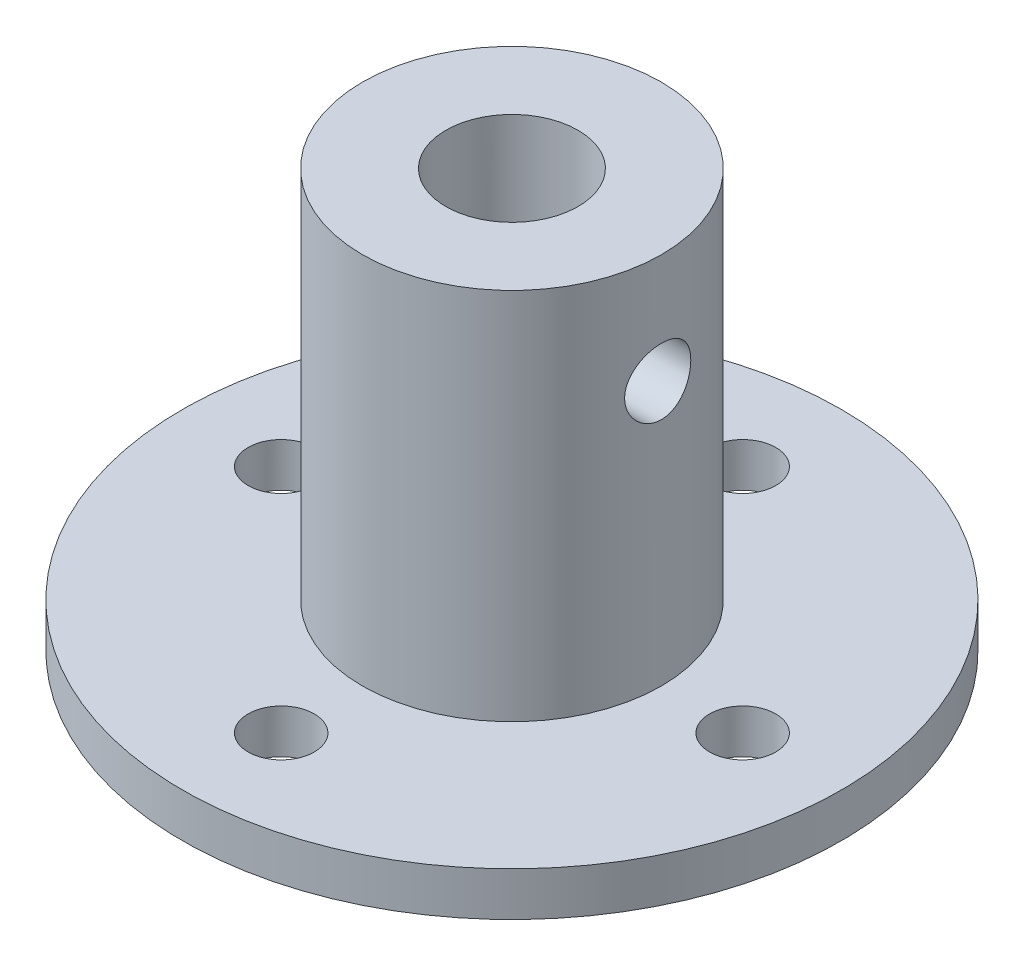
ISO-10303-21;
HEADER;
FILE_DESCRIPTION(('STEP AP214'),'2;1');
FILE_NAME('part.step','',(''),(''),'','','');
FILE_SCHEMA(('AUTOMOTIVE_DESIGN { 1 0 10303 214 1 1 1 1 }'));
ENDSEC;
DATA;
#1=APPLICATION_CONTEXT('core data for automotive mechanical design processes');
#2=APPLICATION_PROTOCOL_DEFINITION('international standard','automotive_design',2000,#1);
#3=PRODUCT_CONTEXT('',#1,'mechanical');
#4=PRODUCT('Part','Part','',(#3));
#5=PRODUCT_RELATED_PRODUCT_CATEGORY('part','',(#4));
#6=PRODUCT_DEFINITION_FORMATION('','',#4);
#7=PRODUCT_DEFINITION_CONTEXT('part definition',#1,'design');
#8=PRODUCT_DEFINITION('design','',#6,#7);
#9=PRODUCT_DEFINITION_SHAPE('','',#8);
#10=(LENGTH_UNIT() NAMED_UNIT(*) SI_UNIT(.MILLI.,.METRE.));
#11=(NAMED_UNIT(*) PLANE_ANGLE_UNIT() SI_UNIT($,.RADIAN.));
#12=(NAMED_UNIT(*) SI_UNIT($,.STERADIAN.) SOLID_ANGLE_UNIT());
#13=UNCERTAINTY_MEASURE_WITH_UNIT(LENGTH_MEASURE(1.E-05),#10,'distance_accuracy_value','');
#14=(GEOMETRIC_REPRESENTATION_CONTEXT(3) GLOBAL_UNCERTAINTY_ASSIGNED_CONTEXT((#13)) GLOBAL_UNIT_ASSIGNED_CONTEXT((#10,
#11,#12)) REPRESENTATION_CONTEXT('',''));
#15=CARTESIAN_POINT('',(0.,0.,0.));
#16=DIRECTION('',(0.,0.,1.));
#17=DIRECTION('',(1.,0.,0.));
#18=AXIS2_PLACEMENT_3D('',#15,#16,#17);
#19=CARTESIAN_POINT('',(0.,1.5875,-21.8080060784619));
#20=DIRECTION('',(0.,1.,0.));
#21=DIRECTION('',(0.,0.,1.));
#22=AXIS2_PLACEMENT_3D('',#19,#20,#21);
#23=PLANE('',#22);
#24=CARTESIAN_POINT('',(8.3312,1.5875,0.));
#25=DIRECTION('',(0.,1.,0.));
#26=DIRECTION('',(0.,0.,1.));
#27=AXIS2_PLACEMENT_3D('',#24,#25,#26);
#28=CIRCLE('',#27,1.1938);
#29=CARTESIAN_POINT('',(8.3312,1.5875,1.1938));
#30=VERTEX_POINT('',#29);
#31=EDGE_CURVE('E133',#30,#30,#28,.F.);
#32=ORIENTED_EDGE('',*,*,#31,.F.);
#33=EDGE_LOOP('',(#32));
#34=FACE_BOUND('',#33,.T.);
#35=CARTESIAN_POINT('',(-8.3312,1.5875,0.));
#36=DIRECTION('',(0.,1.,0.));
#37=DIRECTION('',(0.,0.,1.));
#38=AXIS2_PLACEMENT_3D('',#35,#36,#37);
#39=CIRCLE('',#38,1.1938);
#40=CARTESIAN_POINT('',(-8.3312,1.5875,1.1938));
#41=VERTEX_POINT('',#40);
#42=EDGE_CURVE('E57',#41,#41,#39,.F.);
#43=ORIENTED_EDGE('',*,*,#42,.F.);
#44=EDGE_LOOP('',(#43));
#45=FACE_BOUND('',#44,.T.);
#46=CARTESIAN_POINT('',(0.,1.5875,0.));
#47=DIRECTION('',(0.,-1.,0.));
#48=DIRECTION('',(0.,0.,-1.));
#49=AXIS2_PLACEMENT_3D('',#46,#47,#48);
#50=CIRCLE('',#49,3.9243);
#51=CARTESIAN_POINT('',(0.,1.5875,-3.9243));
#52=VERTEX_POINT('',#51);
#53=EDGE_CURVE('E39',#52,#52,#50,.T.);
#54=ORIENTED_EDGE('',*,*,#53,.F.);
#55=EDGE_LOOP('',(#54));
#56=FACE_BOUND('',#55,.T.);
#57=CARTESIAN_POINT('',(0.,1.5875,0.));
#58=DIRECTION('',(0.,-1.,0.));
#59=DIRECTION('',(0.,0.,-1.));
#60=AXIS2_PLACEMENT_3D('',#57,#58,#59);
#61=CIRCLE('',#60,11.8999);
#62=CARTESIAN_POINT('',(0.,1.5875,-11.8999));
#63=VERTEX_POINT('',#62);
#64=EDGE_CURVE('E44',#63,#63,#61,.T.);
#65=ORIENTED_EDGE('',*,*,#64,.T.);
#66=EDGE_LOOP('',(#65));
#67=FACE_BOUND('',#66,.T.);
#68=CARTESIAN_POINT('',(0.,1.5875,-8.3312));
#69=DIRECTION('',(0.,1.,0.));
#70=DIRECTION('',(0.,0.,1.));
#71=AXIS2_PLACEMENT_3D('',#68,#69,#70);
#72=CIRCLE('',#71,1.1938);
#73=CARTESIAN_POINT('',(0.,1.5875,-7.1374));
#74=VERTEX_POINT('',#73);
#75=EDGE_CURVE('E125',#74,#74,#72,.F.);
#76=ORIENTED_EDGE('',*,*,#75,.F.);
#77=EDGE_LOOP('',(#76));
#78=FACE_BOUND('',#77,.T.);
#79=CARTESIAN_POINT('',(0.,1.5875,8.3312));
#80=DIRECTION('',(0.,1.,0.));
#81=DIRECTION('',(0.,0.,1.));
#82=AXIS2_PLACEMENT_3D('',#79,#80,#81);
#83=CIRCLE('',#82,1.1938);
#84=CARTESIAN_POINT('',(0.,1.5875,9.525));
#85=VERTEX_POINT('',#84);
#86=EDGE_CURVE('E128',#85,#85,#83,.F.);
#87=ORIENTED_EDGE('',*,*,#86,.F.);
#88=EDGE_LOOP('',(#87));
#89=FACE_BOUND('',#88,.T.);
#90=ADVANCED_FACE('F31',(#34,#45,#56,#67,#78,#89),#23,.F.);
#91=CARTESIAN_POINT('',(0.,3.175,-21.8080060784619));
#92=DIRECTION('',(0.,-1.,0.));
#93=DIRECTION('',(0.,0.,-1.));
#94=AXIS2_PLACEMENT_3D('',#91,#92,#93);
#95=PLANE('',#94);
#96=CARTESIAN_POINT('',(8.3312,3.175,0.));
#97=DIRECTION('',(0.,-1.,0.));
#98=DIRECTION('',(0.,0.,-1.));
#99=AXIS2_PLACEMENT_3D('',#96,#97,#98);
#100=CIRCLE('',#99,1.1938);
#101=CARTESIAN_POINT('',(8.3312,3.175,-1.1938));
#102=VERTEX_POINT('',#101);
#103=EDGE_CURVE('E130',#102,#102,#100,.F.);
#104=ORIENTED_EDGE('',*,*,#103,.F.);
#105=EDGE_LOOP('',(#104));
#106=FACE_BOUND('',#105,.T.);
#107=CARTESIAN_POINT('',(-8.3312,3.175,0.));
#108=DIRECTION('',(0.,-1.,0.));
#109=DIRECTION('',(0.,0.,-1.));
#110=AXIS2_PLACEMENT_3D('',#107,#108,#109);
#111=CIRCLE('',#110,1.1938);
#112=CARTESIAN_POINT('',(-8.3312,3.175,-1.1938));
#113=VERTEX_POINT('',#112);
#114=EDGE_CURVE('E138',#113,#113,#111,.F.);
#115=ORIENTED_EDGE('',*,*,#114,.F.);
#116=EDGE_LOOP('',(#115));
#117=FACE_BOUND('',#116,.T.);
#118=CARTESIAN_POINT('',(0.,3.175,0.));
#119=DIRECTION('',(0.,-1.,0.));
#120=DIRECTION('',(0.,0.,-1.));
#121=AXIS2_PLACEMENT_3D('',#118,#119,#120);
#122=CIRCLE('',#121,11.8999);
#123=CARTESIAN_POINT('',(0.,3.175,-11.8999));
#124=VERTEX_POINT('',#123);
#125=EDGE_CURVE('E176',#124,#124,#122,.T.);
#126=ORIENTED_EDGE('',*,*,#125,.F.);
#127=EDGE_LOOP('',(#126));
#128=FACE_BOUND('',#127,.T.);
#129=CARTESIAN_POINT('',(0.,3.175,0.));
#130=DIRECTION('',(0.,-1.,0.));
#131=DIRECTION('',(0.,0.,-1.));
#132=AXIS2_PLACEMENT_3D('',#129,#130,#131);
#133=CIRCLE('',#132,5.3975);
#134=CARTESIAN_POINT('',(0.,3.175,-5.3975));
#135=VERTEX_POINT('',#134);
#136=EDGE_CURVE('E179',#135,#135,#133,.T.);
#137=ORIENTED_EDGE('',*,*,#136,.T.);
#138=EDGE_LOOP('',(#137));
#139=FACE_BOUND('',#138,.T.);
#140=CARTESIAN_POINT('',(0.,3.175,-8.3312));
#141=DIRECTION('',(0.,-1.,0.));
#142=DIRECTION('',(0.,0.,-1.));
#143=AXIS2_PLACEMENT_3D('',#140,#141,#142);
#144=CIRCLE('',#143,1.1938);
#145=CARTESIAN_POINT('',(0.,3.175,-9.525));
#146=VERTEX_POINT('',#145);
#147=EDGE_CURVE('E137',#146,#146,#144,.F.);
#148=ORIENTED_EDGE('',*,*,#147,.F.);
#149=EDGE_LOOP('',(#148));
#150=FACE_BOUND('',#149,.T.);
#151=CARTESIAN_POINT('',(0.,3.175,8.3312));
#152=DIRECTION('',(0.,-1.,0.));
#153=DIRECTION('',(0.,0.,-1.));
#154=AXIS2_PLACEMENT_3D('',#151,#152,#153);
#155=CIRCLE('',#154,1.1938);
#156=CARTESIAN_POINT('',(0.,3.175,7.1374));
#157=VERTEX_POINT('',#156);
#158=EDGE_CURVE('E35',#157,#157,#155,.F.);
#159=ORIENTED_EDGE('',*,*,#158,.F.);
#160=EDGE_LOOP('',(#159));
#161=FACE_BOUND('',#160,.T.);
#162=ADVANCED_FACE('F98',(#106,#117,#128,#139,#150,#161),#95,.F.);
#163=CARTESIAN_POINT('',(0.,0.,-21.8080060784619));
#164=DIRECTION('',(0.,1.,0.));
#165=DIRECTION('',(0.,0.,1.));
#166=AXIS2_PLACEMENT_3D('',#163,#164,#165);
#167=PLANE('',#166);
#168=CARTESIAN_POINT('',(0.,0.,0.));
#169=DIRECTION('',(0.,-1.,0.));
#170=DIRECTION('',(0.,0.,-1.));
#171=AXIS2_PLACEMENT_3D('',#168,#169,#170);
#172=CIRCLE('',#171,2.3876);
#173=CARTESIAN_POINT('',(0.,0.,-2.3876));
#174=VERTEX_POINT('',#173);
#175=EDGE_CURVE('E189',#174,#174,#172,.T.);
#176=ORIENTED_EDGE('',*,*,#175,.F.);
#177=EDGE_LOOP('',(#176));
#178=FACE_BOUND('',#177,.T.);
#179=CARTESIAN_POINT('',(0.,0.,0.));
#180=DIRECTION('',(0.,-1.,0.));
#181=DIRECTION('',(0.,0.,-1.));
#182=AXIS2_PLACEMENT_3D('',#179,#180,#181);
#183=CIRCLE('',#182,3.9243);
#184=CARTESIAN_POINT('',(0.,0.,-3.9243));
#185=VERTEX_POINT('',#184);
#186=EDGE_CURVE('E10',#185,#185,#183,.T.);
#187=ORIENTED_EDGE('',*,*,#186,.T.);
#188=EDGE_LOOP('',(#187));
#189=FACE_BOUND('',#188,.T.);
#190=ADVANCED_FACE('F33',(#178,#189),#167,.F.);
#191=CARTESIAN_POINT('',(0.,0.,0.));
#192=DIRECTION('',(0.,-1.,0.));
#193=DIRECTION('',(0.,0.,-1.));
#194=AXIS2_PLACEMENT_3D('',#191,#192,#193);
#195=CYLINDRICAL_SURFACE('',#194,3.9243);
#196=ORIENTED_EDGE('',*,*,#186,.F.);
#197=EDGE_LOOP('',(#196));
#198=FACE_BOUND('',#197,.T.);
#199=ORIENTED_EDGE('',*,*,#53,.T.);
#200=EDGE_LOOP('',(#199));
#201=FACE_BOUND('',#200,.T.);
#202=ADVANCED_FACE('F105',(#198,#201),#195,.T.);
#203=CARTESIAN_POINT('',(0.,0.,0.));
#204=DIRECTION('',(0.,-1.,0.));
#205=DIRECTION('',(0.,0.,-1.));
#206=AXIS2_PLACEMENT_3D('',#203,#204,#205);
#207=CYLINDRICAL_SURFACE('',#206,11.8999);
#208=ORIENTED_EDGE('',*,*,#64,.F.);
#209=EDGE_LOOP('',(#208));
#210=FACE_BOUND('',#209,.T.);
#211=ORIENTED_EDGE('',*,*,#125,.T.);
#212=EDGE_LOOP('',(#211));
#213=FACE_BOUND('',#212,.T.);
#214=ADVANCED_FACE('F96',(#210,#213),#207,.T.);
#215=CARTESIAN_POINT('',(0.,0.,0.));
#216=DIRECTION('',(0.,-1.,0.));
#217=DIRECTION('',(0.,0.,-1.));
#218=AXIS2_PLACEMENT_3D('',#215,#216,#217);
#219=CYLINDRICAL_SURFACE('',#218,5.3975);
#220=CARTESIAN_POINT('',(-5.26382444711067,12.7,-1.1938));
#221=CARTESIAN_POINT('',(-5.26382578415347,12.7661702685941,-1.19379774984588));
#222=CARTESIAN_POINT('',(-5.26508575545003,12.8323674141414,-1.1882797309663));
#223=CARTESIAN_POINT('',(-5.26997997867348,12.9628778214841,-1.16637841218524));
#224=CARTESIAN_POINT('',(-5.27361592215716,13.0271897069721,-1.14998737118579));
#225=CARTESIAN_POINT('',(-5.28283061311481,13.1520228509558,-1.10688248680728));
#226=CARTESIAN_POINT('',(-5.2884072006729,13.2125482357961,-1.08018011621852));
#227=CARTESIAN_POINT('',(-5.30087223338352,13.328261867473,-1.01724355777763));
#228=CARTESIAN_POINT('',(-5.30776065774752,13.3834501988645,-0.981009520969179));
#229=CARTESIAN_POINT('',(-5.32220613392169,13.4878769294094,-0.899371098034646));
#230=CARTESIAN_POINT('',(-5.32977190142588,13.5370097292132,-0.8538331544698));
#231=CARTESIAN_POINT('',(-5.34464334205277,13.6270054491259,-0.755167843248626));
#232=CARTESIAN_POINT('',(-5.35194899463663,13.6678677173761,-0.702039877931926));
#233=CARTESIAN_POINT('',(-5.36557208684666,13.740581218177,-0.588993479205267));
#234=CARTESIAN_POINT('',(-5.37187804298682,13.7723307223337,-0.529008109283108));
#235=CARTESIAN_POINT('',(-5.38269270912959,13.8252590529265,-0.404390487241094));
#236=CARTESIAN_POINT('',(-5.38720162541889,13.8464390927282,-0.339758769493096));
#237=CARTESIAN_POINT('',(-5.3938525870581,13.8772946916617,-0.208781328778443));
#238=CARTESIAN_POINT('',(-5.39603137251229,13.8871490195043,-0.142479617233934));
#239=CARTESIAN_POINT('',(-5.39790393023066,13.895632565009,-0.00913067513711657));
#240=CARTESIAN_POINT('',(-5.39759799292244,13.894263094568,0.057916467370424));
#241=CARTESIAN_POINT('',(-5.39456360089335,13.8804707243369,0.189620119857848));
#242=CARTESIAN_POINT('',(-5.39187738295879,13.8682405339713,0.254297927469926));
#243=CARTESIAN_POINT('',(-5.38443245616669,13.8333811786812,0.380659749790105));
#244=CARTESIAN_POINT('',(-5.37967365222839,13.8107515366748,0.442343627006063));
#245=CARTESIAN_POINT('',(-5.36855057930608,13.7555662803426,0.561499548515559));
#246=CARTESIAN_POINT('',(-5.36217461019906,13.7229379514426,0.618936779227974));
#247=CARTESIAN_POINT('',(-5.34851578071422,13.6487358066008,0.727590737089718));
#248=CARTESIAN_POINT('',(-5.34123279425877,13.6071607464552,0.778806597494365));
#249=CARTESIAN_POINT('',(-5.32637742354258,13.5151972982437,0.87471039835053));
#250=CARTESIAN_POINT('',(-5.31880217870766,13.4646402597448,0.9192363191774));
#251=CARTESIAN_POINT('',(-5.30436094157517,13.3566983480059,0.999208447324352));
#252=CARTESIAN_POINT('',(-5.29749496939257,13.2993132812222,1.03465439717848));
#253=CARTESIAN_POINT('',(-5.28524189323355,13.1790782350536,1.09553468711881));
#254=CARTESIAN_POINT('',(-5.27985941819434,13.1162119382469,1.12093779540818));
#255=CARTESIAN_POINT('',(-5.27124647395836,12.9869553942399,1.16076978074624));
#256=CARTESIAN_POINT('',(-5.26801565487397,12.9205657218837,1.17520044211354));
#257=CARTESIAN_POINT('',(-5.26414334960272,12.7876290680902,1.19242531072601));
#258=CARTESIAN_POINT('',(-5.26344931699878,12.7211141839457,1.19545569988305));
#259=CARTESIAN_POINT('',(-5.26458732330362,12.5885296153253,1.19043397004535));
#260=CARTESIAN_POINT('',(-5.26641918444991,12.5224598998489,1.18238263093924));
#261=CARTESIAN_POINT('',(-5.27235289802696,12.3934675071958,1.15563107848453));
#262=CARTESIAN_POINT('',(-5.27642688785295,12.3305163390316,1.13706149274304));
#263=CARTESIAN_POINT('',(-5.2863605903461,12.2086189415852,1.08994225559975));
#264=CARTESIAN_POINT('',(-5.29222047708606,12.149673103391,1.06139163129826));
#265=CARTESIAN_POINT('',(-5.30518080244967,12.0364391143524,0.994602353773198));
#266=CARTESIAN_POINT('',(-5.31229928674315,11.982238701375,0.956218524361973));
#267=CARTESIAN_POINT('',(-5.32692739394632,11.8809616620235,0.87104189418985));
#268=CARTESIAN_POINT('',(-5.33443706649221,11.8338859426455,0.824248024460122));
#269=CARTESIAN_POINT('',(-5.34917497399701,11.7472749207666,0.722509719120593));
#270=CARTESIAN_POINT('',(-5.35639509359001,11.7079008189224,0.667426675166462));
#271=CARTESIAN_POINT('',(-5.36958980353617,11.6389648036399,0.55129108882186));
#272=CARTESIAN_POINT('',(-5.37556445273891,11.6094024265496,0.490238828682533));
#273=CARTESIAN_POINT('',(-5.38556088659178,11.5611520564143,0.364282469944756));
#274=CARTESIAN_POINT('',(-5.38959516936264,11.5423943104059,0.299406128860069));
#275=CARTESIAN_POINT('',(-5.39531040949971,11.5160683519074,0.167323618069814));
#276=CARTESIAN_POINT('',(-5.39699171710073,11.5084984741202,0.10011779662831));
#277=CARTESIAN_POINT('',(-5.39780088062668,11.504839416257,-0.0331868714888969));
#278=CARTESIAN_POINT('',(-5.39698221905978,11.5085097756106,-0.0992789072242101));
#279=CARTESIAN_POINT('',(-5.39299831354787,11.5266881916768,-0.229879270685647));
#280=CARTESIAN_POINT('',(-5.38983311364613,11.5411960449754,-0.294387628113086));
#281=CARTESIAN_POINT('',(-5.38151606202691,11.5805213018768,-0.419798590757465));
#282=CARTESIAN_POINT('',(-5.37637092218423,11.6053038964672,-0.48071258459367));
#283=CARTESIAN_POINT('',(-5.36464281096966,11.664441476956,-0.597549436520733));
#284=CARTESIAN_POINT('',(-5.35805969667744,11.698797414443,-0.653471797714204));
#285=CARTESIAN_POINT('',(-5.34401403622104,11.7768867737438,-0.759908553552908));
#286=CARTESIAN_POINT('',(-5.33653693136061,11.8207888707088,-0.810297285973092));
#287=CARTESIAN_POINT('',(-5.3216234124524,11.9163850193007,-0.903074561644765));
#288=CARTESIAN_POINT('',(-5.31418700867946,11.9680809522167,-0.945461167750838));
#289=CARTESIAN_POINT('',(-5.30008278439156,12.0786517226949,-1.02159301434042));
#290=CARTESIAN_POINT('',(-5.29342692905017,12.1376154444118,-1.05521151093274));
#291=CARTESIAN_POINT('',(-5.28178853264086,12.2604909420044,-1.1120085881044));
#292=CARTESIAN_POINT('',(-5.27680459054452,12.3243985194823,-1.13519591537155));
#293=CARTESIAN_POINT('',(-5.26998548571928,12.4402994262764,-1.16638257437939));
#294=CARTESIAN_POINT('',(-5.26769057534933,12.4916689378175,-1.17664420182981));
#295=CARTESIAN_POINT('',(-5.26460956577482,12.5953533949017,-1.19035363082945));
#296=CARTESIAN_POINT('',(-5.26382338969116,12.6476682921345,-1.19380177956672));
#297=CARTESIAN_POINT('',(-5.26382444711067,12.7,-1.1938));
#298=B_SPLINE_CURVE_WITH_KNOTS('',3,(#220,#221,#222,#223,#224,#225,#226,#227,#228,#229,#230,
#231,#232,#233,#234,#235,#236,#237,#238,#239,#240,#241,#242,#243,#244,#245,#246,#247,#248,#249,
#250,#251,#252,#253,#254,#255,#256,#257,#258,#259,#260,#261,#262,#263,#264,#265,#266,#267,#268,
#269,#270,#271,#272,#273,#274,#275,#276,#277,#278,#279,#280,#281,#282,#283,#284,#285,#286,#287,
#288,#289,#290,#291,#292,#293,#294,#295,#296,#297),.UNSPECIFIED.,.T.,.F.,(4,2,2,2,2,2,2,2,2,2,2,
2,2,2,2,2,2,2,2,2,2,2,2,2,2,2,2,2,2,2,2,2,2,2,2,2,2,2,4),(0.,0.198318987053293,
0.396779319976053,0.595019471430783,0.793256481659141,0.994569177374323,1.19589773378243,
1.39939337351754,1.60286564674728,1.80308012505208,2.00327120156167,2.19997958211363,
2.39669698769732,2.59488039097799,2.7930913730513,2.9955183038815,3.19795097396737,
3.40100831967772,3.60403263751931,3.8028269308147,4.00160723446165,4.1979713451246,
4.39435460167822,4.5938235678414,4.7933179057142,4.99662269227714,5.19991787032853,
5.40188545717413,5.60382297842302,5.80147088332305,5.99911507857167,6.19609509179323,
6.39309469178263,6.5939083017002,6.79477046218211,6.99839266255881,7.20184380303858,
7.35869521677338,7.51553863777134),.UNSPECIFIED.);
#299=CARTESIAN_POINT('',(-5.26382444711067,12.7,-1.1938));
#300=VERTEX_POINT('',#299);
#301=EDGE_CURVE('E85',#300,#300,#298,.T.);
#302=ORIENTED_EDGE('',*,*,#301,.T.);
#303=EDGE_LOOP('',(#302));
#304=FACE_BOUND('',#303,.T.);
#305=CARTESIAN_POINT('',(5.26382444711067,12.7,-1.1938));
#306=CARTESIAN_POINT('',(5.26382578415347,12.6338297314059,-1.19379774984588));
#307=CARTESIAN_POINT('',(5.26508575545003,12.5676325858586,-1.1882797309663));
#308=CARTESIAN_POINT('',(5.26997997867348,12.4371221785159,-1.16637841218524));
#309=CARTESIAN_POINT('',(5.27361592215716,12.3728102930279,-1.14998737118579));
#310=CARTESIAN_POINT('',(5.28283061311481,12.2479771490442,-1.10688248680728));
#311=CARTESIAN_POINT('',(5.2884072006729,12.1874517642039,-1.08018011621852));
#312=CARTESIAN_POINT('',(5.30087223338352,12.071738132527,-1.01724355777763));
#313=CARTESIAN_POINT('',(5.30776065774752,12.0165498011355,-0.981009520969178));
#314=CARTESIAN_POINT('',(5.32220613392169,11.9121230705906,-0.899371098034646));
#315=CARTESIAN_POINT('',(5.32977190142588,11.8629902707868,-0.8538331544698));
#316=CARTESIAN_POINT('',(5.34464334205277,11.7729945508741,-0.755167843248626));
#317=CARTESIAN_POINT('',(5.35194899463663,11.7321322826239,-0.702039877931926));
#318=CARTESIAN_POINT('',(5.36557208684666,11.659418781823,-0.588993479205267));
#319=CARTESIAN_POINT('',(5.37187804298682,11.6276692776663,-0.529008109283107));
#320=CARTESIAN_POINT('',(5.38269270912959,11.5747409470735,-0.404390487241093));
#321=CARTESIAN_POINT('',(5.38720162541889,11.5535609072718,-0.339758769493095));
#322=CARTESIAN_POINT('',(5.3938525870581,11.5227053083383,-0.208781328778443));
#323=CARTESIAN_POINT('',(5.39603137251229,11.5128509804957,-0.142479617233934));
#324=CARTESIAN_POINT('',(5.39790393023066,11.504367434991,-0.0091306751371166));
#325=CARTESIAN_POINT('',(5.39759799292244,11.505736905432,0.057916467370424));
#326=CARTESIAN_POINT('',(5.39456360089335,11.5195292756631,0.189620119857848));
#327=CARTESIAN_POINT('',(5.39187738295879,11.5317594660287,0.254297927469926));
#328=CARTESIAN_POINT('',(5.38443245616669,11.5666188213188,0.380659749790105));
#329=CARTESIAN_POINT('',(5.37967365222839,11.5892484633252,0.442343627006063));
#330=CARTESIAN_POINT('',(5.36855057930608,11.6444337196574,0.561499548515559));
#331=CARTESIAN_POINT('',(5.36217461019906,11.6770620485574,0.618936779227974));
#332=CARTESIAN_POINT('',(5.34851578071422,11.7512641933992,0.727590737089719));
#333=CARTESIAN_POINT('',(5.34123279425877,11.7928392535448,0.778806597494365));
#334=CARTESIAN_POINT('',(5.32637742354258,11.8848027017563,0.874710398350531));
#335=CARTESIAN_POINT('',(5.31880217870766,11.9353597402552,0.9192363191774));
#336=CARTESIAN_POINT('',(5.30436094157517,12.0433016519941,0.999208447324352));
#337=CARTESIAN_POINT('',(5.29749496939257,12.1006867187778,1.03465439717848));
#338=CARTESIAN_POINT('',(5.28524189323355,12.2209217649464,1.09553468711881));
#339=CARTESIAN_POINT('',(5.27985941819434,12.2837880617531,1.12093779540818));
#340=CARTESIAN_POINT('',(5.27124647395836,12.4130446057601,1.16076978074624));
#341=CARTESIAN_POINT('',(5.26801565487397,12.4794342781163,1.17520044211354));
#342=CARTESIAN_POINT('',(5.26414334960272,12.6123709319098,1.19242531072601));
#343=CARTESIAN_POINT('',(5.26344931699878,12.6788858160543,1.19545569988305));
#344=CARTESIAN_POINT('',(5.26458732330362,12.8114703846747,1.19043397004535));
#345=CARTESIAN_POINT('',(5.26641918444991,12.8775401001511,1.18238263093924));
#346=CARTESIAN_POINT('',(5.27235289802696,13.0065324928042,1.15563107848453));
#347=CARTESIAN_POINT('',(5.27642688785295,13.0694836609684,1.13706149274304));
#348=CARTESIAN_POINT('',(5.2863605903461,13.1913810584148,1.08994225559975));
#349=CARTESIAN_POINT('',(5.29222047708606,13.250326896609,1.06139163129826));
#350=CARTESIAN_POINT('',(5.30518080244967,13.3635608856476,0.994602353773198));
#351=CARTESIAN_POINT('',(5.31229928674315,13.417761298625,0.956218524361973));
#352=CARTESIAN_POINT('',(5.32692739394632,13.5190383379765,0.87104189418985));
#353=CARTESIAN_POINT('',(5.33443706649221,13.5661140573545,0.824248024460122));
#354=CARTESIAN_POINT('',(5.34917497399701,13.6527250792334,0.722509719120593));
#355=CARTESIAN_POINT('',(5.35639509359001,13.6920991810776,0.667426675166462));
#356=CARTESIAN_POINT('',(5.36958980353617,13.7610351963601,0.55129108882186));
#357=CARTESIAN_POINT('',(5.37556445273891,13.7905975734504,0.490238828682533));
#358=CARTESIAN_POINT('',(5.38556088659178,13.8388479435857,0.364282469944756));
#359=CARTESIAN_POINT('',(5.38959516936264,13.8576056895941,0.299406128860069));
#360=CARTESIAN_POINT('',(5.39531040949971,13.8839316480926,0.167323618069814));
#361=CARTESIAN_POINT('',(5.39699171710073,13.8915015258798,0.10011779662831));
#362=CARTESIAN_POINT('',(5.39780088062668,13.895160583743,-0.0331868714888969));
#363=CARTESIAN_POINT('',(5.39698221905978,13.8914902243894,-0.0992789072242101));
#364=CARTESIAN_POINT('',(5.39299831354787,13.8733118083232,-0.229879270685647));
#365=CARTESIAN_POINT('',(5.38983311364613,13.8588039550246,-0.294387628113086));
#366=CARTESIAN_POINT('',(5.38151606202691,13.8194786981232,-0.419798590757465));
#367=CARTESIAN_POINT('',(5.37637092218423,13.7946961035328,-0.48071258459367));
#368=CARTESIAN_POINT('',(5.36464281096966,13.7355585230441,-0.597549436520733));
#369=CARTESIAN_POINT('',(5.35805969667744,13.701202585557,-0.653471797714204));
#370=CARTESIAN_POINT('',(5.34401403622104,13.6231132262562,-0.759908553552908));
#371=CARTESIAN_POINT('',(5.33653693136061,13.5792111292912,-0.810297285973092));
#372=CARTESIAN_POINT('',(5.3216234124524,13.4836149806993,-0.903074561644765));
#373=CARTESIAN_POINT('',(5.31418700867946,13.4319190477832,-0.945461167750838));
#374=CARTESIAN_POINT('',(5.30008278439156,13.3213482773051,-1.02159301434042));
#375=CARTESIAN_POINT('',(5.29342692905017,13.2623845555882,-1.05521151093274));
#376=CARTESIAN_POINT('',(5.28178853264086,13.1395090579956,-1.1120085881044));
#377=CARTESIAN_POINT('',(5.27680459054452,13.0756014805177,-1.13519591537155));
#378=CARTESIAN_POINT('',(5.26998548571928,12.9597005737236,-1.16638257437939));
#379=CARTESIAN_POINT('',(5.26769057534933,12.9083310621825,-1.17664420182981));
#380=CARTESIAN_POINT('',(5.26460956577482,12.8046466050983,-1.19035363082945));
#381=CARTESIAN_POINT('',(5.26382338969116,12.7523317078655,-1.19380177956672));
#382=CARTESIAN_POINT('',(5.26382444711067,12.7,-1.1938));
#383=B_SPLINE_CURVE_WITH_KNOTS('',3,(#305,#306,#307,#308,#309,#310,#311,#312,#313,#314,#315,
#316,#317,#318,#319,#320,#321,#322,#323,#324,#325,#326,#327,#328,#329,#330,#331,#332,#333,#334,
#335,#336,#337,#338,#339,#340,#341,#342,#343,#344,#345,#346,#347,#348,#349,#350,#351,#352,#353,
#354,#355,#356,#357,#358,#359,#360,#361,#362,#363,#364,#365,#366,#367,#368,#369,#370,#371,#372,
#373,#374,#375,#376,#377,#378,#379,#380,#381,#382),.UNSPECIFIED.,.T.,.F.,(4,2,2,2,2,2,2,2,2,2,2,
2,2,2,2,2,2,2,2,2,2,2,2,2,2,2,2,2,2,2,2,2,2,2,2,2,2,2,4),(0.,0.198318987053293,
0.396779319976053,0.595019471430787,0.793256481659141,0.994569177374323,1.19589773378243,
1.39939337351754,1.60286564674728,1.80308012505208,2.00327120156167,2.19997958211363,
2.39669698769732,2.59488039097799,2.7930913730513,2.9955183038815,3.19795097396737,
3.40100831967772,3.60403263751931,3.8028269308147,4.00160723446165,4.1979713451246,
4.39435460167822,4.5938235678414,4.7933179057142,4.99662269227714,5.19991787032853,
5.40188545717413,5.60382297842302,5.80147088332305,5.99911507857167,6.19609509179323,
6.39309469178263,6.5939083017002,6.79477046218211,6.99839266255881,7.20184380303858,
7.35869521677338,7.51553863777134),.UNSPECIFIED.);
#384=CARTESIAN_POINT('',(5.26382444711067,12.7,-1.1938));
#385=VERTEX_POINT('',#384);
#386=EDGE_CURVE('E78',#385,#385,#383,.T.);
#387=ORIENTED_EDGE('',*,*,#386,.T.);
#388=EDGE_LOOP('',(#387));
#389=FACE_BOUND('',#388,.T.);
#390=ORIENTED_EDGE('',*,*,#136,.F.);
#391=EDGE_LOOP('',(#390));
#392=FACE_BOUND('',#391,.T.);
#393=CARTESIAN_POINT('',(0.,16.6624,0.));
#394=DIRECTION('',(0.,-1.,0.));
#395=DIRECTION('',(0.,0.,-1.));
#396=AXIS2_PLACEMENT_3D('',#393,#394,#395);
#397=CIRCLE('',#396,5.3975);
#398=CARTESIAN_POINT('',(0.,16.6624,-5.3975));
#399=VERTEX_POINT('',#398);
#400=EDGE_CURVE('E181',#399,#399,#397,.T.);
#401=ORIENTED_EDGE('',*,*,#400,.T.);
#402=EDGE_LOOP('',(#401));
#403=FACE_BOUND('',#402,.T.);
#404=ADVANCED_FACE('F91',(#304,#389,#392,#403),#219,.T.);
#405=CARTESIAN_POINT('',(0.,16.6624,-21.8080060784619));
#406=DIRECTION('',(0.,-1.,0.));
#407=DIRECTION('',(0.,0.,-1.));
#408=AXIS2_PLACEMENT_3D('',#405,#406,#407);
#409=PLANE('',#408);
#410=ORIENTED_EDGE('',*,*,#400,.F.);
#411=EDGE_LOOP('',(#410));
#412=FACE_BOUND('',#411,.T.);
#413=CARTESIAN_POINT('',(0.,16.6624,0.));
#414=DIRECTION('',(0.,-1.,0.));
#415=DIRECTION('',(0.,0.,-1.));
#416=AXIS2_PLACEMENT_3D('',#413,#414,#415);
#417=CIRCLE('',#416,2.3876);
#418=CARTESIAN_POINT('',(0.,16.6624,-2.3876));
#419=VERTEX_POINT('',#418);
#420=EDGE_CURVE('E185',#419,#419,#417,.T.);
#421=ORIENTED_EDGE('',*,*,#420,.T.);
#422=EDGE_LOOP('',(#421));
#423=FACE_BOUND('',#422,.T.);
#424=ADVANCED_FACE('F95',(#412,#423),#409,.F.);
#425=CARTESIAN_POINT('',(0.,0.,0.));
#426=DIRECTION('',(0.,-1.,0.));
#427=DIRECTION('',(0.,0.,-1.));
#428=AXIS2_PLACEMENT_3D('',#425,#426,#427);
#429=CYLINDRICAL_SURFACE('',#428,2.3876);
#430=CARTESIAN_POINT('',(-2.06772225407573,12.7,-1.1938));
#431=CARTESIAN_POINT('',(-2.06772767358835,12.6377936985765,-1.19379565823838));
#432=CARTESIAN_POINT('',(-2.07057209857944,12.5755088509214,-1.18890538506131));
#433=CARTESIAN_POINT('',(-2.0815379307046,12.4528508514284,-1.1695935679763));
#434=CARTESIAN_POINT('',(-2.08967042583527,12.3924819966212,-1.15515199586478));
#435=CARTESIAN_POINT('',(-2.11003369977525,12.2756618031062,-1.11751611875784));
#436=CARTESIAN_POINT('',(-2.12224265498368,12.219191495877,-1.09436834128702));
#437=CARTESIAN_POINT('',(-2.14934933258365,12.1109501876563,-1.04011917179431));
#438=CARTESIAN_POINT('',(-2.16424720042126,12.0591794410967,-1.00901734949191));
#439=CARTESIAN_POINT('',(-2.19655462280774,11.957091421248,-0.936734916085764));
#440=CARTESIAN_POINT('',(-2.21406999170989,11.9072462038329,-0.894934600748433));
#441=CARTESIAN_POINT('',(-2.24878473049575,11.8149066659201,-0.803730395530152));
#442=CARTESIAN_POINT('',(-2.26598393895746,11.7724160121078,-0.754322735998901));
#443=CARTESIAN_POINT('',(-2.29951519186431,11.6931882949599,-0.645236440804285));
#444=CARTESIAN_POINT('',(-2.31571063442014,11.6570321319293,-0.585089962243212));
#445=CARTESIAN_POINT('',(-2.34403532631618,11.5955668493952,-0.458606658354489));
#446=CARTESIAN_POINT('',(-2.35616714075151,11.5702508843834,-0.392273772029331));
#447=CARTESIAN_POINT('',(-2.37423494633371,11.5330549353387,-0.260302054058833));
#448=CARTESIAN_POINT('',(-2.38055037487701,11.5203470954368,-0.194949677485552));
#449=CARTESIAN_POINT('',(-2.38769053595435,11.5060016875257,-0.0627588165394923));
#450=CARTESIAN_POINT('',(-2.38851859071443,11.5043574212773,0.0040787440562539));
#451=CARTESIAN_POINT('',(-2.38477047811858,11.5118665793858,0.131118067657072));
#452=CARTESIAN_POINT('',(-2.38065800396061,11.5200934629292,0.191391447577252));
#453=CARTESIAN_POINT('',(-2.36819173991086,11.5454531514534,0.309568780916092));
#454=CARTESIAN_POINT('',(-2.35983763264461,11.5625866228598,0.367472556681927));
#455=CARTESIAN_POINT('',(-2.33950876128802,11.605383967398,0.480276951655732));
#456=CARTESIAN_POINT('',(-2.32748550297558,11.6311625826648,0.535124936992419));
#457=CARTESIAN_POINT('',(-2.30090201778907,11.6903596662613,0.639849105646611));
#458=CARTESIAN_POINT('',(-2.28634088308805,11.7237808697703,0.689723499783575));
#459=CARTESIAN_POINT('',(-2.254424380338,11.8009436706601,0.788115316380264));
#460=CARTESIAN_POINT('',(-2.23693499066621,11.8453621952156,0.83605881877005));
#461=CARTESIAN_POINT('',(-2.20201591792536,11.9414472136216,0.924125797261489));
#462=CARTESIAN_POINT('',(-2.18458629083508,11.9931192318208,0.964243256777316));
#463=CARTESIAN_POINT('',(-2.15056093543208,12.1062614121159,1.03801546849587));
#464=CARTESIAN_POINT('',(-2.13408845204907,12.1681454143221,1.0710980306208));
#465=CARTESIAN_POINT('',(-2.10557012542564,12.2976149920684,1.12613435710087));
#466=CARTESIAN_POINT('',(-2.09351966668995,12.3651945317364,1.14809973417216));
#467=CARTESIAN_POINT('',(-2.07655106238376,12.4985038835694,1.17849573592169));
#468=CARTESIAN_POINT('',(-2.07114338751935,12.5639558879142,1.18786099078683));
#469=CARTESIAN_POINT('',(-2.06668172133889,12.6957039215024,1.19561093086472));
#470=CARTESIAN_POINT('',(-2.0676232418846,12.7619993214832,1.19400337256268));
#471=CARTESIAN_POINT('',(-2.0752343096215,12.8858196479993,1.18071122854403));
#472=CARTESIAN_POINT('',(-2.08126599565444,12.9435106687326,1.17014821559134));
#473=CARTESIAN_POINT('',(-2.09743522927991,13.0561914632503,1.14091022459421));
#474=CARTESIAN_POINT('',(-2.10757410646809,13.1111803558213,1.12223261952087));
#475=CARTESIAN_POINT('',(-2.13136541918694,13.2197940468316,1.07638689127651));
#476=CARTESIAN_POINT('',(-2.14515883703569,13.2732377103198,1.04886559323637));
#477=CARTESIAN_POINT('',(-2.17457975455817,13.3750572163632,0.986421497022067));
#478=CARTESIAN_POINT('',(-2.19020819455375,13.4234304364262,0.9514948966918));
#479=CARTESIAN_POINT('',(-2.22390612557174,13.5201152526696,0.870085810201992));
#480=CARTESIAN_POINT('',(-2.2420349896959,13.5676504385267,0.822701626089607));
#481=CARTESIAN_POINT('',(-2.27698529716608,13.6543383297167,0.720344286606477));
#482=CARTESIAN_POINT('',(-2.29380629766203,13.6934882035412,0.665368578043554));
#483=CARTESIAN_POINT('',(-2.32482237586664,13.7631669140392,0.547399515822645));
#484=CARTESIAN_POINT('',(-2.33893643428069,13.7934409565202,0.484232853883977));
#485=CARTESIAN_POINT('',(-2.36233149150414,13.842631229625,0.352794598908524));
#486=CARTESIAN_POINT('',(-2.37161673320854,13.8615574334011,0.28452754792198));
#487=CARTESIAN_POINT('',(-2.38363071267532,13.8858833919117,0.151588344766053));
#488=CARTESIAN_POINT('',(-2.38688285936799,13.8923649042209,0.0871610616686765));
#489=CARTESIAN_POINT('',(-2.38810295241832,13.8948066902995,-0.0419334020285457));
#490=CARTESIAN_POINT('',(-2.38607274858253,13.8907706471714,-0.106600490732273));
#491=CARTESIAN_POINT('',(-2.37726131998712,13.8730082935674,-0.229851855228209));
#492=CARTESIAN_POINT('',(-2.37080197654646,13.8599380429562,-0.288556165003086));
#493=CARTESIAN_POINT('',(-2.35407921415395,13.8253630282321,-0.402842977716802));
#494=CARTESIAN_POINT('',(-2.34381524968331,13.8038570545524,-0.458425031659885));
#495=CARTESIAN_POINT('',(-2.31986296127106,13.7520636451243,-0.567560462375143));
#496=CARTESIAN_POINT('',(-2.30604695211926,13.7214399639545,-0.620925395355315));
#497=CARTESIAN_POINT('',(-2.27643493344712,13.6527026221405,-0.721979967397583));
#498=CARTESIAN_POINT('',(-2.26063801573371,13.6145855213857,-0.769666983611916));
#499=CARTESIAN_POINT('',(-2.22677854888548,13.5275455754347,-0.863014738162497));
#500=CARTESIAN_POINT('',(-2.20864698060165,13.4779248624497,-0.908001515802984));
#501=CARTESIAN_POINT('',(-2.17346900323213,13.3715713291153,-0.989258232491765));
#502=CARTESIAN_POINT('',(-2.15642356390515,13.3148322836482,-1.02552045976201));
#503=CARTESIAN_POINT('',(-2.12495928813009,13.1934731713117,-1.08926022304811));
#504=CARTESIAN_POINT('',(-2.11064048027135,13.1286607133385,-1.11642393174417));
#505=CARTESIAN_POINT('',(-2.08755217424786,12.9944717756992,-1.15903500340875));
#506=CARTESIAN_POINT('',(-2.07876413277127,12.925111417216,-1.17452155202513));
#507=CARTESIAN_POINT('',(-2.07159245632018,12.8291627664226,-1.18707533398854));
#508=CARTESIAN_POINT('',(-2.0701462440635,12.8034214076678,-1.18959317410584));
#509=CARTESIAN_POINT('',(-2.06820998262796,12.7517912453615,-1.1929564669964));
#510=CARTESIAN_POINT('',(-2.06771999741435,12.7259024320625,-1.19380180789057));
#511=CARTESIAN_POINT('',(-2.06772225407573,12.7,-1.1938));
#512=B_SPLINE_CURVE_WITH_KNOTS('',3,(#430,#431,#432,#433,#434,#435,#436,#437,#438,#439,#440,
#441,#442,#443,#444,#445,#446,#447,#448,#449,#450,#451,#452,#453,#454,#455,#456,#457,#458,#459,
#460,#461,#462,#463,#464,#465,#466,#467,#468,#469,#470,#471,#472,#473,#474,#475,#476,#477,#478,
#479,#480,#481,#482,#483,#484,#485,#486,#487,#488,#489,#490,#491,#492,#493,#494,#495,#496,#497,
#498,#499,#500,#501,#502,#503,#504,#505,#506,#507,#508,#509,#510,#511),.UNSPECIFIED.,.T.,.F.,(4,
2,2,2,2,2,2,2,2,2,2,2,2,2,2,2,2,2,2,2,2,2,2,2,2,2,2,2,2,2,2,2,2,2,2,2,2,2,2,2,4),(0.,
0.186509907953573,0.373412155454251,0.559329437807967,0.745256779636419,0.946519028660391,
1.14788133160522,1.36281691754636,1.57761657229493,1.77713228354721,1.97652719076395,
2.15858257177042,2.34065157683338,2.52523958562043,2.70989375964355,2.91200281161236,
3.11426663595977,3.32937499256615,3.54425818653933,3.74211282821758,3.9398276244828,
4.11591420171601,4.29205782798172,4.47635958449587,4.66075619849492,4.86839690486536,
5.07610761610978,5.28930019770798,5.50230513735711,5.69576628390969,5.88915969214643,
6.06980954411588,6.25048530826641,6.43888864208906,6.62737867174238,6.83462726720611,
7.04205838568545,7.25604472202286,7.46930973778695,7.54696645384222,7.62462836443983),.UNSPECIFIED.);
#513=CARTESIAN_POINT('',(-2.06772225407573,12.7,-1.1938));
#514=VERTEX_POINT('',#513);
#515=EDGE_CURVE('E56',#514,#514,#512,.T.);
#516=ORIENTED_EDGE('',*,*,#515,.T.);
#517=EDGE_LOOP('',(#516));
#518=FACE_BOUND('',#517,.T.);
#519=CARTESIAN_POINT('',(2.06772225407573,12.7,-1.1938));
#520=CARTESIAN_POINT('',(2.06772767358835,12.7622063014235,-1.19379565823838));
#521=CARTESIAN_POINT('',(2.07057209857944,12.8244911490786,-1.18890538506131));
#522=CARTESIAN_POINT('',(2.0815379307046,12.9471491485716,-1.1695935679763));
#523=CARTESIAN_POINT('',(2.08967042583527,13.0075180033788,-1.15515199586478));
#524=CARTESIAN_POINT('',(2.11003369977525,13.1243381968938,-1.11751611875784));
#525=CARTESIAN_POINT('',(2.12224265498368,13.180808504123,-1.09436834128702));
#526=CARTESIAN_POINT('',(2.14934933258365,13.2890498123437,-1.04011917179431));
#527=CARTESIAN_POINT('',(2.16424720042126,13.3408205589033,-1.00901734949191));
#528=CARTESIAN_POINT('',(2.19655462280774,13.4429085787519,-0.936734916085764));
#529=CARTESIAN_POINT('',(2.21406999170989,13.4927537961671,-0.894934600748433));
#530=CARTESIAN_POINT('',(2.24878473049575,13.5850933340799,-0.803730395530152));
#531=CARTESIAN_POINT('',(2.26598393895746,13.6275839878922,-0.754322735998901));
#532=CARTESIAN_POINT('',(2.29951519186431,13.7068117050401,-0.645236440804285));
#533=CARTESIAN_POINT('',(2.31571063442014,13.7429678680707,-0.585089962243212));
#534=CARTESIAN_POINT('',(2.34403532631618,13.8044331506048,-0.458606658354489));
#535=CARTESIAN_POINT('',(2.35616714075151,13.8297491156166,-0.392273772029331));
#536=CARTESIAN_POINT('',(2.37423494633371,13.8669450646612,-0.260302054058833));
#537=CARTESIAN_POINT('',(2.38055037487701,13.8796529045632,-0.194949677485552));
#538=CARTESIAN_POINT('',(2.38769053595435,13.8939983124743,-0.0627588165394923));
#539=CARTESIAN_POINT('',(2.38851859071443,13.8956425787227,0.0040787440562539));
#540=CARTESIAN_POINT('',(2.38477047811858,13.8881334206142,0.131118067657072));
#541=CARTESIAN_POINT('',(2.38065800396061,13.8799065370708,0.191391447577252));
#542=CARTESIAN_POINT('',(2.36819173991086,13.8545468485466,0.309568780916092));
#543=CARTESIAN_POINT('',(2.35983763264461,13.8374133771402,0.367472556681927));
#544=CARTESIAN_POINT('',(2.33950876128802,13.794616032602,0.480276951655732));
#545=CARTESIAN_POINT('',(2.32748550297558,13.7688374173352,0.535124936992419));
#546=CARTESIAN_POINT('',(2.30090201778907,13.7096403337387,0.63984910564661));
#547=CARTESIAN_POINT('',(2.28634088308805,13.6762191302297,0.689723499783574));
#548=CARTESIAN_POINT('',(2.254424380338,13.5990563293399,0.788115316380264));
#549=CARTESIAN_POINT('',(2.23693499066621,13.5546378047844,0.83605881877005));
#550=CARTESIAN_POINT('',(2.20201591792536,13.4585527863784,0.924125797261489));
#551=CARTESIAN_POINT('',(2.18458629083508,13.4068807681792,0.964243256777316));
#552=CARTESIAN_POINT('',(2.15056093543208,13.2937385878841,1.03801546849587));
#553=CARTESIAN_POINT('',(2.13408845204907,13.2318545856779,1.0710980306208));
#554=CARTESIAN_POINT('',(2.10557012542564,13.1023850079316,1.12613435710087));
#555=CARTESIAN_POINT('',(2.09351966668995,13.0348054682636,1.14809973417216));
#556=CARTESIAN_POINT('',(2.07655106238376,12.9014961164306,1.17849573592169));
#557=CARTESIAN_POINT('',(2.07114338751935,12.8360441120858,1.18786099078683));
#558=CARTESIAN_POINT('',(2.06668172133889,12.7042960784976,1.19561093086472));
#559=CARTESIAN_POINT('',(2.0676232418846,12.6380006785168,1.19400337256268));
#560=CARTESIAN_POINT('',(2.0752343096215,12.5141803520007,1.18071122854403));
#561=CARTESIAN_POINT('',(2.08126599565444,12.4564893312674,1.17014821559134));
#562=CARTESIAN_POINT('',(2.09743522927991,12.3438085367497,1.14091022459421));
#563=CARTESIAN_POINT('',(2.10757410646809,12.2888196441787,1.12223261952087));
#564=CARTESIAN_POINT('',(2.13136541918694,12.1802059531684,1.07638689127651));
#565=CARTESIAN_POINT('',(2.14515883703569,12.1267622896802,1.04886559323637));
#566=CARTESIAN_POINT('',(2.17457975455817,12.0249427836367,0.986421497022067));
#567=CARTESIAN_POINT('',(2.19020819455375,11.9765695635738,0.9514948966918));
#568=CARTESIAN_POINT('',(2.22390612557174,11.8798847473304,0.870085810201992));
#569=CARTESIAN_POINT('',(2.2420349896959,11.8323495614733,0.822701626089607));
#570=CARTESIAN_POINT('',(2.27698529716608,11.7456616702833,0.720344286606477));
#571=CARTESIAN_POINT('',(2.29380629766203,11.7065117964588,0.665368578043554));
#572=CARTESIAN_POINT('',(2.32482237586664,11.6368330859608,0.547399515822645));
#573=CARTESIAN_POINT('',(2.33893643428069,11.6065590434798,0.484232853883977));
#574=CARTESIAN_POINT('',(2.36233149150414,11.557368770375,0.352794598908524));
#575=CARTESIAN_POINT('',(2.37161673320854,11.5384425665989,0.28452754792198));
#576=CARTESIAN_POINT('',(2.38363071267532,11.5141166080883,0.151588344766053));
#577=CARTESIAN_POINT('',(2.38688285936799,11.5076350957791,0.0871610616686766));
#578=CARTESIAN_POINT('',(2.38810295241832,11.5051933097005,-0.0419334020285457));
#579=CARTESIAN_POINT('',(2.38607274858253,11.5092293528286,-0.106600490732274));
#580=CARTESIAN_POINT('',(2.37726131998712,11.5269917064326,-0.229851855228209));
#581=CARTESIAN_POINT('',(2.37080197654646,11.5400619570438,-0.288556165003086));
#582=CARTESIAN_POINT('',(2.35407921415395,11.5746369717679,-0.402842977716802));
#583=CARTESIAN_POINT('',(2.34381524968331,11.5961429454476,-0.458425031659886));
#584=CARTESIAN_POINT('',(2.31986296127106,11.6479363548757,-0.567560462375143));
#585=CARTESIAN_POINT('',(2.30604695211926,11.6785600360455,-0.620925395355315));
#586=CARTESIAN_POINT('',(2.27643493344712,11.7472973778595,-0.721979967397582));
#587=CARTESIAN_POINT('',(2.26063801573371,11.7854144786143,-0.769666983611916));
#588=CARTESIAN_POINT('',(2.22677854888548,11.8724544245653,-0.863014738162497));
#589=CARTESIAN_POINT('',(2.20864698060165,11.9220751375503,-0.908001515802983));
#590=CARTESIAN_POINT('',(2.17346900323213,12.0284286708847,-0.989258232491764));
#591=CARTESIAN_POINT('',(2.15642356390515,12.0851677163518,-1.02552045976201));
#592=CARTESIAN_POINT('',(2.12495928813009,12.2065268286883,-1.08926022304811));
#593=CARTESIAN_POINT('',(2.11064048027135,12.2713392866615,-1.11642393174417));
#594=CARTESIAN_POINT('',(2.08755217424786,12.4055282243008,-1.15903500340875));
#595=CARTESIAN_POINT('',(2.07876413277127,12.474888582784,-1.17452155202513));
#596=CARTESIAN_POINT('',(2.07159245632018,12.5708372335774,-1.18707533398854));
#597=CARTESIAN_POINT('',(2.0701462440635,12.5965785923322,-1.18959317410584));
#598=CARTESIAN_POINT('',(2.06820998262796,12.6482087546385,-1.1929564669964));
#599=CARTESIAN_POINT('',(2.06771999741435,12.6740975679375,-1.19380180789057));
#600=CARTESIAN_POINT('',(2.06772225407573,12.7,-1.1938));
#601=B_SPLINE_CURVE_WITH_KNOTS('',3,(#519,#520,#521,#522,#523,#524,#525,#526,#527,#528,#529,
#530,#531,#532,#533,#534,#535,#536,#537,#538,#539,#540,#541,#542,#543,#544,#545,#546,#547,#548,
#549,#550,#551,#552,#553,#554,#555,#556,#557,#558,#559,#560,#561,#562,#563,#564,#565,#566,#567,
#568,#569,#570,#571,#572,#573,#574,#575,#576,#577,#578,#579,#580,#581,#582,#583,#584,#585,#586,
#587,#588,#589,#590,#591,#592,#593,#594,#595,#596,#597,#598,#599,#600),.UNSPECIFIED.,.T.,.F.,(4,
2,2,2,2,2,2,2,2,2,2,2,2,2,2,2,2,2,2,2,2,2,2,2,2,2,2,2,2,2,2,2,2,2,2,2,2,2,2,2,4),(0.,
0.186509907953573,0.373412155454251,0.559329437807965,0.745256779636419,0.946519028660391,
1.14788133160522,1.36281691754636,1.57761657229493,1.77713228354721,1.97652719076395,
2.15858257177042,2.34065157683338,2.52523958562043,2.70989375964355,2.91200281161236,
3.11426663595977,3.32937499256615,3.54425818653933,3.74211282821758,3.9398276244828,
4.11591420171601,4.29205782798172,4.47635958449587,4.66075619849492,4.86839690486536,
5.07610761610978,5.28930019770798,5.50230513735711,5.69576628390969,5.88915969214643,
6.06980954411588,6.25048530826641,6.43888864208906,6.62737867174238,6.83462726720611,
7.04205838568545,7.25604472202286,7.46930973778695,7.54696645384222,7.62462836443983),.UNSPECIFIED.);
#602=CARTESIAN_POINT('',(2.06772225407573,12.7,-1.1938));
#603=VERTEX_POINT('',#602);
#604=EDGE_CURVE('E48',#603,#603,#601,.T.);
#605=ORIENTED_EDGE('',*,*,#604,.T.);
#606=EDGE_LOOP('',(#605));
#607=FACE_BOUND('',#606,.T.);
#608=ORIENTED_EDGE('',*,*,#420,.F.);
#609=EDGE_LOOP('',(#608));
#610=FACE_BOUND('',#609,.T.);
#611=ORIENTED_EDGE('',*,*,#175,.T.);
#612=EDGE_LOOP('',(#611));
#613=FACE_BOUND('',#612,.T.);
#614=ADVANCED_FACE('F62',(#518,#607,#610,#613),#429,.F.);
#615=CARTESIAN_POINT('',(-11.8999,12.7,0.));
#616=DIRECTION('',(1.,0.,0.));
#617=DIRECTION('',(0.,0.,-1.));
#618=AXIS2_PLACEMENT_3D('',#615,#616,#617);
#619=CYLINDRICAL_SURFACE('',#618,1.1938);
#620=ORIENTED_EDGE('',*,*,#604,.F.);
#621=EDGE_LOOP('',(#620));
#622=FACE_BOUND('',#621,.T.);
#623=ORIENTED_EDGE('',*,*,#386,.F.);
#624=EDGE_LOOP('',(#623));
#625=FACE_BOUND('',#624,.T.);
#626=ADVANCED_FACE('F70',(#622,#625),#619,.F.);
#627=ORIENTED_EDGE('',*,*,#515,.F.);
#628=EDGE_LOOP('',(#627));
#629=FACE_BOUND('',#628,.T.);
#630=ORIENTED_EDGE('',*,*,#301,.F.);
#631=EDGE_LOOP('',(#630));
#632=FACE_BOUND('',#631,.T.);
#633=ADVANCED_FACE('F65',(#629,#632),#619,.F.);
#634=CARTESIAN_POINT('',(-8.3312,16.6624,0.));
#635=DIRECTION('',(0.,-1.,0.));
#636=DIRECTION('',(0.,0.,-1.));
#637=AXIS2_PLACEMENT_3D('',#634,#635,#636);
#638=CYLINDRICAL_SURFACE('',#637,1.1938);
#639=ORIENTED_EDGE('',*,*,#114,.T.);
#640=EDGE_LOOP('',(#639));
#641=FACE_BOUND('',#640,.T.);
#642=ORIENTED_EDGE('',*,*,#42,.T.);
#643=EDGE_LOOP('',(#642));
#644=FACE_BOUND('',#643,.T.);
#645=ADVANCED_FACE('F69',(#641,#644),#638,.F.);
#646=CARTESIAN_POINT('',(0.,16.6624,-8.3312));
#647=DIRECTION('',(0.,-1.,0.));
#648=DIRECTION('',(0.,0.,-1.));
#649=AXIS2_PLACEMENT_3D('',#646,#647,#648);
#650=CYLINDRICAL_SURFACE('',#649,1.1938);
#651=ORIENTED_EDGE('',*,*,#147,.T.);
#652=EDGE_LOOP('',(#651));
#653=FACE_BOUND('',#652,.T.);
#654=ORIENTED_EDGE('',*,*,#75,.T.);
#655=EDGE_LOOP('',(#654));
#656=FACE_BOUND('',#655,.T.);
#657=ADVANCED_FACE('F145',(#653,#656),#650,.F.);
#658=CARTESIAN_POINT('',(8.3312,16.6624,0.));
#659=DIRECTION('',(0.,-1.,0.));
#660=DIRECTION('',(0.,0.,-1.));
#661=AXIS2_PLACEMENT_3D('',#658,#659,#660);
#662=CYLINDRICAL_SURFACE('',#661,1.1938);
#663=ORIENTED_EDGE('',*,*,#103,.T.);
#664=EDGE_LOOP('',(#663));
#665=FACE_BOUND('',#664,.T.);
#666=ORIENTED_EDGE('',*,*,#31,.T.);
#667=EDGE_LOOP('',(#666));
#668=FACE_BOUND('',#667,.T.);
#669=ADVANCED_FACE('F152',(#665,#668),#662,.F.);
#670=CARTESIAN_POINT('',(0.,16.6624,8.3312));
#671=DIRECTION('',(0.,-1.,0.));
#672=DIRECTION('',(0.,0.,-1.));
#673=AXIS2_PLACEMENT_3D('',#670,#671,#672);
#674=CYLINDRICAL_SURFACE('',#673,1.1938);
#675=ORIENTED_EDGE('',*,*,#158,.T.);
#676=EDGE_LOOP('',(#675));
#677=FACE_BOUND('',#676,.T.);
#678=ORIENTED_EDGE('',*,*,#86,.T.);
#679=EDGE_LOOP('',(#678));
#680=FACE_BOUND('',#679,.T.);
#681=ADVANCED_FACE('F150',(#677,#680),#674,.F.);
#682=CLOSED_SHELL('',(#90,#162,#190,#202,#214,#404,#424,#614,#626,#633,#645,#657,#669,#681));
#683=MANIFOLD_SOLID_BREP('B2',#682);
#684=ADVANCED_BREP_SHAPE_REPRESENTATION('',(#18,#683),#14);
#685=SHAPE_DEFINITION_REPRESENTATION(#9,#684);
ENDSEC;
END-ISO-10303-21;
